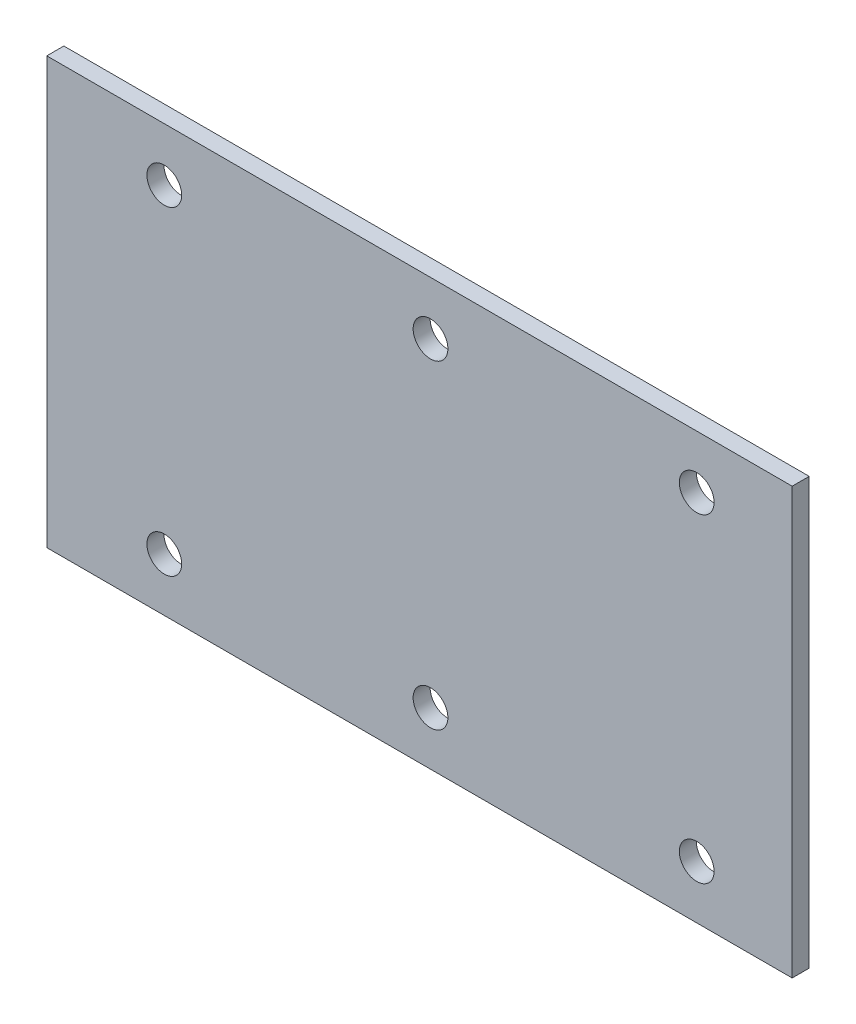
ISO-10303-21;
HEADER;
FILE_DESCRIPTION(('STEP AP214'),'2;1');
FILE_NAME('part.step','',(''),(''),'','','');
FILE_SCHEMA(('AUTOMOTIVE_DESIGN { 1 0 10303 214 1 1 1 1 }'));
ENDSEC;
DATA;
#1=APPLICATION_CONTEXT('core data for automotive mechanical design processes');
#2=APPLICATION_PROTOCOL_DEFINITION('international standard','automotive_design',2000,#1);
#3=PRODUCT_CONTEXT('',#1,'mechanical');
#4=PRODUCT('Part','Part','',(#3));
#5=PRODUCT_RELATED_PRODUCT_CATEGORY('part','',(#4));
#6=PRODUCT_DEFINITION_FORMATION('','',#4);
#7=PRODUCT_DEFINITION_CONTEXT('part definition',#1,'design');
#8=PRODUCT_DEFINITION('design','',#6,#7);
#9=PRODUCT_DEFINITION_SHAPE('','',#8);
#10=(LENGTH_UNIT() NAMED_UNIT(*) SI_UNIT(.MILLI.,.METRE.));
#11=(NAMED_UNIT(*) PLANE_ANGLE_UNIT() SI_UNIT($,.RADIAN.));
#12=(NAMED_UNIT(*) SI_UNIT($,.STERADIAN.) SOLID_ANGLE_UNIT());
#13=UNCERTAINTY_MEASURE_WITH_UNIT(LENGTH_MEASURE(1.E-05),#10,'distance_accuracy_value','');
#14=(GEOMETRIC_REPRESENTATION_CONTEXT(3) GLOBAL_UNCERTAINTY_ASSIGNED_CONTEXT((#13)) GLOBAL_UNIT_ASSIGNED_CONTEXT((#10,
#11,#12)) REPRESENTATION_CONTEXT('',''));
#15=CARTESIAN_POINT('',(0.,0.,0.));
#16=DIRECTION('',(0.,0.,1.));
#17=DIRECTION('',(1.,0.,0.));
#18=AXIS2_PLACEMENT_3D('',#15,#16,#17);
#19=CARTESIAN_POINT('',(55.,-75.,-0.045));
#20=DIRECTION('',(0.,0.,-1.));
#21=DIRECTION('',(0.,-1.,0.));
#22=AXIS2_PLACEMENT_3D('',#19,#20,#21);
#23=CYLINDRICAL_SURFACE('',#22,1.63195);
#24=CARTESIAN_POINT('',(55.,-75.,0.));
#25=DIRECTION('',(0.,0.,-1.));
#26=DIRECTION('',(0.,-1.,0.));
#27=AXIS2_PLACEMENT_3D('',#24,#25,#26);
#28=CIRCLE('',#27,1.63195);
#29=CARTESIAN_POINT('',(55.,-76.63195,0.));
#30=VERTEX_POINT('',#29);
#31=EDGE_CURVE('E196',#30,#30,#28,.T.);
#32=ORIENTED_EDGE('',*,*,#31,.T.);
#33=DIRECTION('',(0.,0.,1.));
#34=VECTOR('',#33,1.);
#35=CARTESIAN_POINT('',(55.,-76.63195,-0.045));
#36=LINE('',#35,#34);
#37=CARTESIAN_POINT('',(55.,-76.63195,1.6));
#38=VERTEX_POINT('',#37);
#39=EDGE_CURVE('E11',#30,#38,#36,.T.);
#40=ORIENTED_EDGE('',*,*,#39,.T.);
#41=CARTESIAN_POINT('',(55.,-75.,1.6));
#42=DIRECTION('',(0.,0.,-1.));
#43=DIRECTION('',(0.,-1.,0.));
#44=AXIS2_PLACEMENT_3D('',#41,#42,#43);
#45=CIRCLE('',#44,1.63195);
#46=EDGE_CURVE('E192',#38,#38,#45,.T.);
#47=ORIENTED_EDGE('',*,*,#46,.F.);
#48=ORIENTED_EDGE('',*,*,#39,.F.);
#49=EDGE_LOOP('',(#32,#40,#47,#48));
#50=FACE_BOUND('',#49,.T.);
#51=ADVANCED_FACE('F17',(#50),#23,.F.);
#52=CARTESIAN_POINT('',(80.,-75.,-0.045));
#53=DIRECTION('',(0.,0.,-1.));
#54=DIRECTION('',(0.,-1.,0.));
#55=AXIS2_PLACEMENT_3D('',#52,#53,#54);
#56=CYLINDRICAL_SURFACE('',#55,1.63195);
#57=CARTESIAN_POINT('',(80.,-75.,0.));
#58=DIRECTION('',(0.,0.,-1.));
#59=DIRECTION('',(0.,-1.,0.));
#60=AXIS2_PLACEMENT_3D('',#57,#58,#59);
#61=CIRCLE('',#60,1.63195);
#62=CARTESIAN_POINT('',(80.,-76.63195,0.));
#63=VERTEX_POINT('',#62);
#64=EDGE_CURVE('E193',#63,#63,#61,.T.);
#65=ORIENTED_EDGE('',*,*,#64,.T.);
#66=DIRECTION('',(0.,0.,1.));
#67=VECTOR('',#66,1.);
#68=CARTESIAN_POINT('',(80.,-76.63195,-0.045));
#69=LINE('',#68,#67);
#70=CARTESIAN_POINT('',(80.,-76.63195,1.6));
#71=VERTEX_POINT('',#70);
#72=EDGE_CURVE('E27',#63,#71,#69,.T.);
#73=ORIENTED_EDGE('',*,*,#72,.T.);
#74=CARTESIAN_POINT('',(80.,-75.,1.6));
#75=DIRECTION('',(0.,0.,-1.));
#76=DIRECTION('',(0.,-1.,0.));
#77=AXIS2_PLACEMENT_3D('',#74,#75,#76);
#78=CIRCLE('',#77,1.63195);
#79=EDGE_CURVE('E217',#71,#71,#78,.T.);
#80=ORIENTED_EDGE('',*,*,#79,.F.);
#81=ORIENTED_EDGE('',*,*,#72,.F.);
#82=EDGE_LOOP('',(#65,#73,#80,#81));
#83=FACE_BOUND('',#82,.T.);
#84=ADVANCED_FACE('F428',(#83),#56,.F.);
#85=CARTESIAN_POINT('',(105.,-75.,-0.045));
#86=DIRECTION('',(0.,0.,-1.));
#87=DIRECTION('',(0.,-1.,0.));
#88=AXIS2_PLACEMENT_3D('',#85,#86,#87);
#89=CYLINDRICAL_SURFACE('',#88,1.63195);
#90=CARTESIAN_POINT('',(105.,-75.,0.));
#91=DIRECTION('',(0.,0.,-1.));
#92=DIRECTION('',(0.,-1.,0.));
#93=AXIS2_PLACEMENT_3D('',#90,#91,#92);
#94=CIRCLE('',#93,1.63195);
#95=CARTESIAN_POINT('',(105.,-76.63195,0.));
#96=VERTEX_POINT('',#95);
#97=EDGE_CURVE('E197',#96,#96,#94,.T.);
#98=ORIENTED_EDGE('',*,*,#97,.T.);
#99=DIRECTION('',(0.,0.,1.));
#100=VECTOR('',#99,1.);
#101=CARTESIAN_POINT('',(105.,-76.63195,-0.045));
#102=LINE('',#101,#100);
#103=CARTESIAN_POINT('',(105.,-76.63195,1.6));
#104=VERTEX_POINT('',#103);
#105=EDGE_CURVE('E69',#96,#104,#102,.T.);
#106=ORIENTED_EDGE('',*,*,#105,.T.);
#107=CARTESIAN_POINT('',(105.,-75.,1.6));
#108=DIRECTION('',(0.,0.,-1.));
#109=DIRECTION('',(0.,-1.,0.));
#110=AXIS2_PLACEMENT_3D('',#107,#108,#109);
#111=CIRCLE('',#110,1.63195);
#112=EDGE_CURVE('E182',#104,#104,#111,.T.);
#113=ORIENTED_EDGE('',*,*,#112,.F.);
#114=ORIENTED_EDGE('',*,*,#105,.F.);
#115=EDGE_LOOP('',(#98,#106,#113,#114));
#116=FACE_BOUND('',#115,.T.);
#117=ADVANCED_FACE('F419',(#116),#89,.F.);
#118=CARTESIAN_POINT('',(55.,-105.,-0.045));
#119=DIRECTION('',(0.,0.,-1.));
#120=DIRECTION('',(0.,-1.,0.));
#121=AXIS2_PLACEMENT_3D('',#118,#119,#120);
#122=CYLINDRICAL_SURFACE('',#121,1.63195);
#123=CARTESIAN_POINT('',(55.,-105.,0.));
#124=DIRECTION('',(0.,0.,-1.));
#125=DIRECTION('',(0.,-1.,0.));
#126=AXIS2_PLACEMENT_3D('',#123,#124,#125);
#127=CIRCLE('',#126,1.63195);
#128=CARTESIAN_POINT('',(55.,-106.63195,0.));
#129=VERTEX_POINT('',#128);
#130=EDGE_CURVE('E209',#129,#129,#127,.T.);
#131=ORIENTED_EDGE('',*,*,#130,.T.);
#132=DIRECTION('',(0.,0.,1.));
#133=VECTOR('',#132,1.);
#134=CARTESIAN_POINT('',(55.,-106.63195,-0.045));
#135=LINE('',#134,#133);
#136=CARTESIAN_POINT('',(55.,-106.63195,1.6));
#137=VERTEX_POINT('',#136);
#138=EDGE_CURVE('E99',#129,#137,#135,.T.);
#139=ORIENTED_EDGE('',*,*,#138,.T.);
#140=CARTESIAN_POINT('',(55.,-105.,1.6));
#141=DIRECTION('',(0.,0.,-1.));
#142=DIRECTION('',(0.,-1.,0.));
#143=AXIS2_PLACEMENT_3D('',#140,#141,#142);
#144=CIRCLE('',#143,1.63195);
#145=EDGE_CURVE('E179',#137,#137,#144,.T.);
#146=ORIENTED_EDGE('',*,*,#145,.F.);
#147=ORIENTED_EDGE('',*,*,#138,.F.);
#148=EDGE_LOOP('',(#131,#139,#146,#147));
#149=FACE_BOUND('',#148,.T.);
#150=ADVANCED_FACE('F410',(#149),#122,.F.);
#151=CARTESIAN_POINT('',(80.,-105.,-0.045));
#152=DIRECTION('',(0.,0.,-1.));
#153=DIRECTION('',(0.,-1.,0.));
#154=AXIS2_PLACEMENT_3D('',#151,#152,#153);
#155=CYLINDRICAL_SURFACE('',#154,1.63195);
#156=CARTESIAN_POINT('',(80.,-105.,0.));
#157=DIRECTION('',(0.,0.,-1.));
#158=DIRECTION('',(0.,-1.,0.));
#159=AXIS2_PLACEMENT_3D('',#156,#157,#158);
#160=CIRCLE('',#159,1.63195);
#161=CARTESIAN_POINT('',(80.,-106.63195,0.));
#162=VERTEX_POINT('',#161);
#163=EDGE_CURVE('E205',#162,#162,#160,.T.);
#164=ORIENTED_EDGE('',*,*,#163,.T.);
#165=DIRECTION('',(0.,0.,1.));
#166=VECTOR('',#165,1.);
#167=CARTESIAN_POINT('',(80.,-106.63195,-0.045));
#168=LINE('',#167,#166);
#169=CARTESIAN_POINT('',(80.,-106.63195,1.6));
#170=VERTEX_POINT('',#169);
#171=EDGE_CURVE('E142',#162,#170,#168,.T.);
#172=ORIENTED_EDGE('',*,*,#171,.T.);
#173=CARTESIAN_POINT('',(80.,-105.,1.6));
#174=DIRECTION('',(0.,0.,-1.));
#175=DIRECTION('',(0.,-1.,0.));
#176=AXIS2_PLACEMENT_3D('',#173,#174,#175);
#177=CIRCLE('',#176,1.63195);
#178=EDGE_CURVE('E183',#170,#170,#177,.T.);
#179=ORIENTED_EDGE('',*,*,#178,.F.);
#180=ORIENTED_EDGE('',*,*,#171,.F.);
#181=EDGE_LOOP('',(#164,#172,#179,#180));
#182=FACE_BOUND('',#181,.T.);
#183=ADVANCED_FACE('F401',(#182),#155,.F.);
#184=CARTESIAN_POINT('',(105.,-105.,-0.045));
#185=DIRECTION('',(0.,0.,-1.));
#186=DIRECTION('',(0.,-1.,0.));
#187=AXIS2_PLACEMENT_3D('',#184,#185,#186);
#188=CYLINDRICAL_SURFACE('',#187,1.63195);
#189=CARTESIAN_POINT('',(105.,-105.,0.));
#190=DIRECTION('',(0.,0.,-1.));
#191=DIRECTION('',(0.,-1.,0.));
#192=AXIS2_PLACEMENT_3D('',#189,#190,#191);
#193=CIRCLE('',#192,1.63195);
#194=CARTESIAN_POINT('',(105.,-106.63195,0.));
#195=VERTEX_POINT('',#194);
#196=EDGE_CURVE('E161',#195,#195,#193,.T.);
#197=ORIENTED_EDGE('',*,*,#196,.T.);
#198=DIRECTION('',(0.,0.,1.));
#199=VECTOR('',#198,1.);
#200=CARTESIAN_POINT('',(105.,-106.63195,-0.045));
#201=LINE('',#200,#199);
#202=CARTESIAN_POINT('',(105.,-106.63195,1.6));
#203=VERTEX_POINT('',#202);
#204=EDGE_CURVE('E150',#195,#203,#201,.T.);
#205=ORIENTED_EDGE('',*,*,#204,.T.);
#206=CARTESIAN_POINT('',(105.,-105.,1.6));
#207=DIRECTION('',(0.,0.,-1.));
#208=DIRECTION('',(0.,-1.,0.));
#209=AXIS2_PLACEMENT_3D('',#206,#207,#208);
#210=CIRCLE('',#209,1.63195);
#211=EDGE_CURVE('E223',#203,#203,#210,.T.);
#212=ORIENTED_EDGE('',*,*,#211,.F.);
#213=ORIENTED_EDGE('',*,*,#204,.F.);
#214=EDGE_LOOP('',(#197,#205,#212,#213));
#215=FACE_BOUND('',#214,.T.);
#216=ADVANCED_FACE('F393',(#215),#188,.F.);
#217=CARTESIAN_POINT('',(43.965,-70.,0.));
#218=DIRECTION('',(0.,1.,0.));
#219=DIRECTION('',(1.,0.,0.));
#220=AXIS2_PLACEMENT_3D('',#217,#218,#219);
#221=PLANE('',#220);
#222=DIRECTION('',(0.,0.,1.));
#223=VECTOR('',#222,1.);
#224=CARTESIAN_POINT('',(43.965,-70.,0.));
#225=LINE('',#224,#223);
#226=CARTESIAN_POINT('',(43.965,-70.,0.));
#227=VERTEX_POINT('',#226);
#228=CARTESIAN_POINT('',(43.965,-70.,1.6));
#229=VERTEX_POINT('',#228);
#230=EDGE_CURVE('E156',#227,#229,#225,.T.);
#231=ORIENTED_EDGE('',*,*,#230,.T.);
#232=DIRECTION('',(1.,0.,0.));
#233=VECTOR('',#232,1.);
#234=CARTESIAN_POINT('',(43.965,-70.,1.6));
#235=LINE('',#234,#233);
#236=CARTESIAN_POINT('',(113.965,-70.,1.6));
#237=VERTEX_POINT('',#236);
#238=EDGE_CURVE('E112',#229,#237,#235,.T.);
#239=ORIENTED_EDGE('',*,*,#238,.T.);
#240=DIRECTION('',(0.,0.,1.));
#241=VECTOR('',#240,1.);
#242=CARTESIAN_POINT('',(113.965,-70.,0.));
#243=LINE('',#242,#241);
#244=CARTESIAN_POINT('',(113.965,-70.,0.));
#245=VERTEX_POINT('',#244);
#246=EDGE_CURVE('E159',#245,#237,#243,.T.);
#247=ORIENTED_EDGE('',*,*,#246,.F.);
#248=DIRECTION('',(1.,0.,0.));
#249=VECTOR('',#248,1.);
#250=CARTESIAN_POINT('',(43.965,-70.,0.));
#251=LINE('',#250,#249);
#252=EDGE_CURVE('E121',#227,#245,#251,.T.);
#253=ORIENTED_EDGE('',*,*,#252,.F.);
#254=EDGE_LOOP('',(#231,#239,#247,#253));
#255=FACE_BOUND('',#254,.T.);
#256=ADVANCED_FACE('F155',(#255),#221,.T.);
#257=CARTESIAN_POINT('',(78.965,-90.,1.6));
#258=DIRECTION('',(0.,0.,-1.));
#259=DIRECTION('',(0.,-1.,0.));
#260=AXIS2_PLACEMENT_3D('',#257,#258,#259);
#261=PLANE('',#260);
#262=ORIENTED_EDGE('',*,*,#46,.T.);
#263=EDGE_LOOP('',(#262));
#264=FACE_BOUND('',#263,.T.);
#265=ORIENTED_EDGE('',*,*,#79,.T.);
#266=EDGE_LOOP('',(#265));
#267=FACE_BOUND('',#266,.T.);
#268=ORIENTED_EDGE('',*,*,#112,.T.);
#269=EDGE_LOOP('',(#268));
#270=FACE_BOUND('',#269,.T.);
#271=ORIENTED_EDGE('',*,*,#145,.T.);
#272=EDGE_LOOP('',(#271));
#273=FACE_BOUND('',#272,.T.);
#274=ORIENTED_EDGE('',*,*,#178,.T.);
#275=EDGE_LOOP('',(#274));
#276=FACE_BOUND('',#275,.T.);
#277=ORIENTED_EDGE('',*,*,#211,.T.);
#278=EDGE_LOOP('',(#277));
#279=FACE_BOUND('',#278,.T.);
#280=DIRECTION('',(0.,-1.,0.));
#281=VECTOR('',#280,1.);
#282=CARTESIAN_POINT('',(113.965,-70.,1.6));
#283=LINE('',#282,#281);
#284=CARTESIAN_POINT('',(113.965,-110.,1.6));
#285=VERTEX_POINT('',#284);
#286=EDGE_CURVE('E214',#237,#285,#283,.T.);
#287=ORIENTED_EDGE('',*,*,#286,.F.);
#288=ORIENTED_EDGE('',*,*,#238,.F.);
#289=DIRECTION('',(0.,1.,0.));
#290=VECTOR('',#289,1.);
#291=CARTESIAN_POINT('',(43.965,-110.,1.6));
#292=LINE('',#291,#290);
#293=CARTESIAN_POINT('',(43.965,-110.,1.6));
#294=VERTEX_POINT('',#293);
#295=EDGE_CURVE('E169',#294,#229,#292,.T.);
#296=ORIENTED_EDGE('',*,*,#295,.F.);
#297=DIRECTION('',(-1.,0.,0.));
#298=VECTOR('',#297,1.);
#299=CARTESIAN_POINT('',(113.965,-110.,1.6));
#300=LINE('',#299,#298);
#301=EDGE_CURVE('E187',#285,#294,#300,.T.);
#302=ORIENTED_EDGE('',*,*,#301,.F.);
#303=EDGE_LOOP('',(#287,#288,#296,#302));
#304=FACE_BOUND('',#303,.T.);
#305=ADVANCED_FACE('F376',(#264,#267,#270,#273,#276,#279,#304),#261,.F.);
#306=CARTESIAN_POINT('',(78.965,-90.,0.));
#307=DIRECTION('',(0.,0.,-1.));
#308=DIRECTION('',(0.,-1.,0.));
#309=AXIS2_PLACEMENT_3D('',#306,#307,#308);
#310=PLANE('',#309);
#311=ORIENTED_EDGE('',*,*,#31,.F.);
#312=EDGE_LOOP('',(#311));
#313=FACE_BOUND('',#312,.T.);
#314=ORIENTED_EDGE('',*,*,#64,.F.);
#315=EDGE_LOOP('',(#314));
#316=FACE_BOUND('',#315,.T.);
#317=ORIENTED_EDGE('',*,*,#97,.F.);
#318=EDGE_LOOP('',(#317));
#319=FACE_BOUND('',#318,.T.);
#320=ORIENTED_EDGE('',*,*,#130,.F.);
#321=EDGE_LOOP('',(#320));
#322=FACE_BOUND('',#321,.T.);
#323=ORIENTED_EDGE('',*,*,#163,.F.);
#324=EDGE_LOOP('',(#323));
#325=FACE_BOUND('',#324,.T.);
#326=ORIENTED_EDGE('',*,*,#196,.F.);
#327=EDGE_LOOP('',(#326));
#328=FACE_BOUND('',#327,.T.);
#329=DIRECTION('',(-1.,0.,0.));
#330=VECTOR('',#329,1.);
#331=CARTESIAN_POINT('',(113.965,-110.,0.));
#332=LINE('',#331,#330);
#333=CARTESIAN_POINT('',(113.965,-110.,0.));
#334=VERTEX_POINT('',#333);
#335=CARTESIAN_POINT('',(43.965,-110.,0.));
#336=VERTEX_POINT('',#335);
#337=EDGE_CURVE('E165',#334,#336,#332,.T.);
#338=ORIENTED_EDGE('',*,*,#337,.T.);
#339=DIRECTION('',(0.,1.,0.));
#340=VECTOR('',#339,1.);
#341=CARTESIAN_POINT('',(43.965,-110.,0.));
#342=LINE('',#341,#340);
#343=EDGE_CURVE('E133',#336,#227,#342,.T.);
#344=ORIENTED_EDGE('',*,*,#343,.T.);
#345=ORIENTED_EDGE('',*,*,#252,.T.);
#346=DIRECTION('',(0.,-1.,0.));
#347=VECTOR('',#346,1.);
#348=CARTESIAN_POINT('',(113.965,-70.,0.));
#349=LINE('',#348,#347);
#350=EDGE_CURVE('E176',#245,#334,#349,.T.);
#351=ORIENTED_EDGE('',*,*,#350,.T.);
#352=EDGE_LOOP('',(#338,#344,#345,#351));
#353=FACE_BOUND('',#352,.T.);
#354=ADVANCED_FACE('F163',(#313,#316,#319,#322,#325,#328,#353),#310,.T.);
#355=CARTESIAN_POINT('',(43.965,-110.,0.));
#356=DIRECTION('',(-1.,0.,0.));
#357=DIRECTION('',(0.,0.,1.));
#358=AXIS2_PLACEMENT_3D('',#355,#356,#357);
#359=PLANE('',#358);
#360=DIRECTION('',(0.,0.,1.));
#361=VECTOR('',#360,1.);
#362=CARTESIAN_POINT('',(43.965,-110.,0.));
#363=LINE('',#362,#361);
#364=EDGE_CURVE('E184',#336,#294,#363,.T.);
#365=ORIENTED_EDGE('',*,*,#364,.T.);
#366=ORIENTED_EDGE('',*,*,#295,.T.);
#367=ORIENTED_EDGE('',*,*,#230,.F.);
#368=ORIENTED_EDGE('',*,*,#343,.F.);
#369=EDGE_LOOP('',(#365,#366,#367,#368));
#370=FACE_BOUND('',#369,.T.);
#371=ADVANCED_FACE('F19',(#370),#359,.T.);
#372=CARTESIAN_POINT('',(113.965,-70.,0.));
#373=DIRECTION('',(1.,0.,0.));
#374=DIRECTION('',(0.,1.,0.));
#375=AXIS2_PLACEMENT_3D('',#372,#373,#374);
#376=PLANE('',#375);
#377=ORIENTED_EDGE('',*,*,#246,.T.);
#378=ORIENTED_EDGE('',*,*,#286,.T.);
#379=DIRECTION('',(0.,0.,1.));
#380=VECTOR('',#379,1.);
#381=CARTESIAN_POINT('',(113.965,-110.,0.));
#382=LINE('',#381,#380);
#383=EDGE_CURVE('E203',#334,#285,#382,.T.);
#384=ORIENTED_EDGE('',*,*,#383,.F.);
#385=ORIENTED_EDGE('',*,*,#350,.F.);
#386=EDGE_LOOP('',(#377,#378,#384,#385));
#387=FACE_BOUND('',#386,.T.);
#388=ADVANCED_FACE('F347',(#387),#376,.T.);
#389=CARTESIAN_POINT('',(113.965,-110.,0.));
#390=DIRECTION('',(0.,-1.,0.));
#391=DIRECTION('',(0.,0.,-1.));
#392=AXIS2_PLACEMENT_3D('',#389,#390,#391);
#393=PLANE('',#392);
#394=ORIENTED_EDGE('',*,*,#383,.T.);
#395=ORIENTED_EDGE('',*,*,#301,.T.);
#396=ORIENTED_EDGE('',*,*,#364,.F.);
#397=ORIENTED_EDGE('',*,*,#337,.F.);
#398=EDGE_LOOP('',(#394,#395,#396,#397));
#399=FACE_BOUND('',#398,.T.);
#400=ADVANCED_FACE('F341',(#399),#393,.T.);
#401=CLOSED_SHELL('',(#51,#84,#117,#150,#183,#216,#256,#305,#354,#371,#388,#400));
#402=MANIFOLD_SOLID_BREP('B1',#401);
#403=ADVANCED_BREP_SHAPE_REPRESENTATION('',(#18,#402),#14);
#404=SHAPE_DEFINITION_REPRESENTATION(#9,#403);
ENDSEC;
END-ISO-10303-21;
